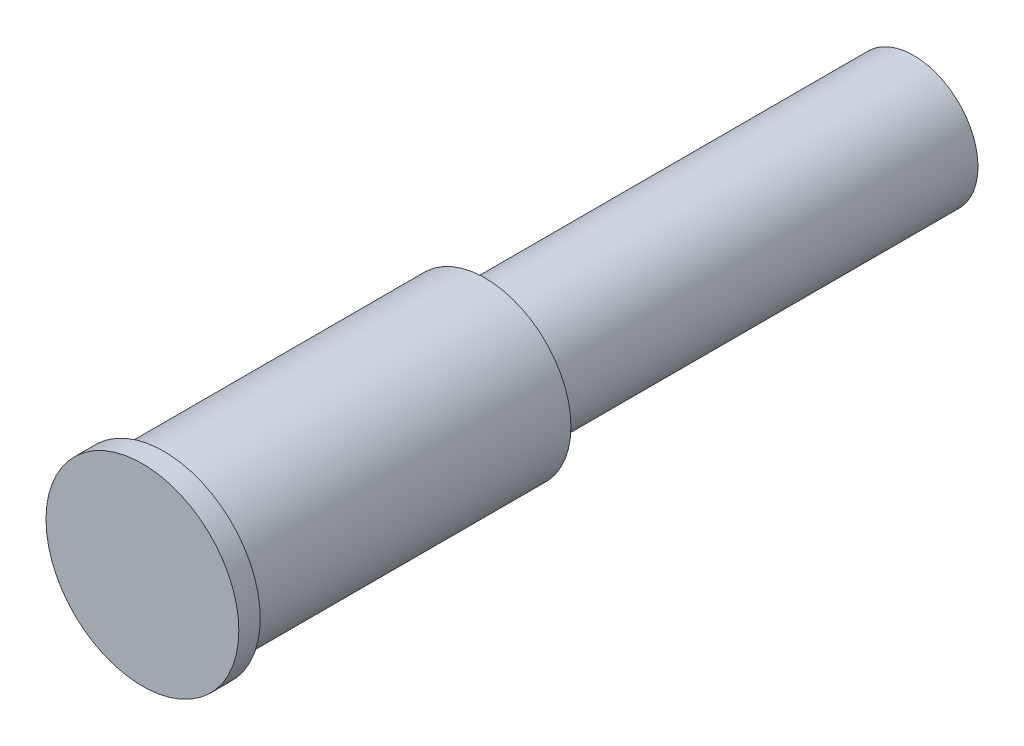
ISO-10303-21;
HEADER;
FILE_DESCRIPTION(('STEP AP214'),'2;1');
FILE_NAME('part.step','',(''),(''),'','','');
FILE_SCHEMA(('AUTOMOTIVE_DESIGN { 1 0 10303 214 1 1 1 1 }'));
ENDSEC;
DATA;
#1=APPLICATION_CONTEXT('core data for automotive mechanical design processes');
#2=APPLICATION_PROTOCOL_DEFINITION('international standard','automotive_design',2000,#1);
#3=PRODUCT_CONTEXT('',#1,'mechanical');
#4=PRODUCT('Part','Part','',(#3));
#5=PRODUCT_RELATED_PRODUCT_CATEGORY('part','',(#4));
#6=PRODUCT_DEFINITION_FORMATION('','',#4);
#7=PRODUCT_DEFINITION_CONTEXT('part definition',#1,'design');
#8=PRODUCT_DEFINITION('design','',#6,#7);
#9=PRODUCT_DEFINITION_SHAPE('','',#8);
#10=(LENGTH_UNIT() NAMED_UNIT(*) SI_UNIT(.MILLI.,.METRE.));
#11=(NAMED_UNIT(*) PLANE_ANGLE_UNIT() SI_UNIT($,.RADIAN.));
#12=(NAMED_UNIT(*) SI_UNIT($,.STERADIAN.) SOLID_ANGLE_UNIT());
#13=UNCERTAINTY_MEASURE_WITH_UNIT(LENGTH_MEASURE(1.E-05),#10,'distance_accuracy_value','');
#14=(GEOMETRIC_REPRESENTATION_CONTEXT(3) GLOBAL_UNCERTAINTY_ASSIGNED_CONTEXT((#13)) GLOBAL_UNIT_ASSIGNED_CONTEXT((#10,
#11,#12)) REPRESENTATION_CONTEXT('',''));
#15=CARTESIAN_POINT('',(0.,0.,0.));
#16=DIRECTION('',(0.,0.,1.));
#17=DIRECTION('',(1.,0.,0.));
#18=AXIS2_PLACEMENT_3D('',#15,#16,#17);
#19=CARTESIAN_POINT('',(0.,0.,20.));
#20=DIRECTION('',(0.,0.,-1.));
#21=DIRECTION('',(-1.,0.,0.));
#22=AXIS2_PLACEMENT_3D('',#19,#20,#21);
#23=CYLINDRICAL_SURFACE('',#22,3.);
#24=CARTESIAN_POINT('',(0.,0.,20.));
#25=DIRECTION('',(0.,0.,1.));
#26=DIRECTION('',(1.,0.,0.));
#27=AXIS2_PLACEMENT_3D('',#24,#25,#26);
#28=CIRCLE('',#27,3.);
#29=CARTESIAN_POINT('',(3.,0.,20.));
#30=VERTEX_POINT('',#29);
#31=EDGE_CURVE('E10',#30,#30,#28,.T.);
#32=ORIENTED_EDGE('',*,*,#31,.F.);
#33=EDGE_LOOP('',(#32));
#34=FACE_BOUND('',#33,.T.);
#35=CARTESIAN_POINT('',(0.,0.,0.));
#36=DIRECTION('',(0.,0.,1.));
#37=DIRECTION('',(1.,0.,0.));
#38=AXIS2_PLACEMENT_3D('',#35,#36,#37);
#39=CIRCLE('',#38,3.);
#40=CARTESIAN_POINT('',(3.,0.,0.));
#41=VERTEX_POINT('',#40);
#42=EDGE_CURVE('E36',#41,#41,#39,.T.);
#43=ORIENTED_EDGE('',*,*,#42,.T.);
#44=EDGE_LOOP('',(#43));
#45=FACE_BOUND('',#44,.T.);
#46=ADVANCED_FACE('F33',(#34,#45),#23,.T.);
#47=CARTESIAN_POINT('',(0.,0.,0.));
#48=DIRECTION('',(0.,0.,1.));
#49=DIRECTION('',(1.,0.,0.));
#50=AXIS2_PLACEMENT_3D('',#47,#48,#49);
#51=PLANE('',#50);
#52=ORIENTED_EDGE('',*,*,#42,.F.);
#53=EDGE_LOOP('',(#52));
#54=FACE_BOUND('',#53,.T.);
#55=ADVANCED_FACE('F75',(#54),#51,.F.);
#56=CARTESIAN_POINT('',(0.,0.,35.));
#57=DIRECTION('',(0.,0.,-1.));
#58=DIRECTION('',(-1.,0.,0.));
#59=AXIS2_PLACEMENT_3D('',#56,#57,#58);
#60=CYLINDRICAL_SURFACE('',#59,4.);
#61=CARTESIAN_POINT('',(0.,0.,35.));
#62=DIRECTION('',(0.,0.,1.));
#63=DIRECTION('',(1.,0.,0.));
#64=AXIS2_PLACEMENT_3D('',#61,#62,#63);
#65=CIRCLE('',#64,4.);
#66=CARTESIAN_POINT('',(4.,0.,35.));
#67=VERTEX_POINT('',#66);
#68=EDGE_CURVE('E43',#67,#67,#65,.T.);
#69=ORIENTED_EDGE('',*,*,#68,.F.);
#70=EDGE_LOOP('',(#69));
#71=FACE_BOUND('',#70,.T.);
#72=CARTESIAN_POINT('',(0.,0.,20.));
#73=DIRECTION('',(0.,0.,1.));
#74=DIRECTION('',(1.,0.,0.));
#75=AXIS2_PLACEMENT_3D('',#72,#73,#74);
#76=CIRCLE('',#75,4.);
#77=CARTESIAN_POINT('',(4.,0.,20.));
#78=VERTEX_POINT('',#77);
#79=EDGE_CURVE('E45',#78,#78,#76,.T.);
#80=ORIENTED_EDGE('',*,*,#79,.T.);
#81=EDGE_LOOP('',(#80));
#82=FACE_BOUND('',#81,.T.);
#83=ADVANCED_FACE('F80',(#71,#82),#60,.T.);
#84=CARTESIAN_POINT('',(0.,0.,20.));
#85=DIRECTION('',(0.,0.,1.));
#86=DIRECTION('',(1.,0.,0.));
#87=AXIS2_PLACEMENT_3D('',#84,#85,#86);
#88=PLANE('',#87);
#89=ORIENTED_EDGE('',*,*,#31,.T.);
#90=EDGE_LOOP('',(#89));
#91=FACE_BOUND('',#90,.T.);
#92=ORIENTED_EDGE('',*,*,#79,.F.);
#93=EDGE_LOOP('',(#92));
#94=FACE_BOUND('',#93,.T.);
#95=ADVANCED_FACE('F62',(#91,#94),#88,.F.);
#96=CARTESIAN_POINT('',(0.,0.,36.));
#97=DIRECTION('',(0.,0.,-1.));
#98=DIRECTION('',(-1.,0.,0.));
#99=AXIS2_PLACEMENT_3D('',#96,#97,#98);
#100=CYLINDRICAL_SURFACE('',#99,4.5);
#101=CARTESIAN_POINT('',(0.,0.,36.));
#102=DIRECTION('',(0.,0.,1.));
#103=DIRECTION('',(1.,0.,0.));
#104=AXIS2_PLACEMENT_3D('',#101,#102,#103);
#105=CIRCLE('',#104,4.5);
#106=CARTESIAN_POINT('',(4.5,0.,36.));
#107=VERTEX_POINT('',#106);
#108=EDGE_CURVE('E48',#107,#107,#105,.T.);
#109=ORIENTED_EDGE('',*,*,#108,.F.);
#110=EDGE_LOOP('',(#109));
#111=FACE_BOUND('',#110,.T.);
#112=CARTESIAN_POINT('',(0.,0.,35.));
#113=DIRECTION('',(0.,0.,1.));
#114=DIRECTION('',(1.,0.,0.));
#115=AXIS2_PLACEMENT_3D('',#112,#113,#114);
#116=CIRCLE('',#115,4.5);
#117=CARTESIAN_POINT('',(4.5,0.,35.));
#118=VERTEX_POINT('',#117);
#119=EDGE_CURVE('E51',#118,#118,#116,.T.);
#120=ORIENTED_EDGE('',*,*,#119,.T.);
#121=EDGE_LOOP('',(#120));
#122=FACE_BOUND('',#121,.T.);
#123=ADVANCED_FACE('F59',(#111,#122),#100,.T.);
#124=CARTESIAN_POINT('',(0.,0.,36.));
#125=DIRECTION('',(0.,0.,1.));
#126=DIRECTION('',(1.,0.,0.));
#127=AXIS2_PLACEMENT_3D('',#124,#125,#126);
#128=PLANE('',#127);
#129=ORIENTED_EDGE('',*,*,#108,.T.);
#130=EDGE_LOOP('',(#129));
#131=FACE_BOUND('',#130,.T.);
#132=ADVANCED_FACE('F57',(#131),#128,.T.);
#133=CARTESIAN_POINT('',(0.,0.,35.));
#134=DIRECTION('',(0.,0.,1.));
#135=DIRECTION('',(1.,0.,0.));
#136=AXIS2_PLACEMENT_3D('',#133,#134,#135);
#137=PLANE('',#136);
#138=ORIENTED_EDGE('',*,*,#68,.T.);
#139=EDGE_LOOP('',(#138));
#140=FACE_BOUND('',#139,.T.);
#141=ORIENTED_EDGE('',*,*,#119,.F.);
#142=EDGE_LOOP('',(#141));
#143=FACE_BOUND('',#142,.T.);
#144=ADVANCED_FACE('F66',(#140,#143),#137,.F.);
#145=CLOSED_SHELL('',(#46,#55,#83,#95,#123,#132,#144));
#146=MANIFOLD_SOLID_BREP('B2',#145);
#147=ADVANCED_BREP_SHAPE_REPRESENTATION('',(#18,#146),#14);
#148=SHAPE_DEFINITION_REPRESENTATION(#9,#147);
ENDSEC;
END-ISO-10303-21;
